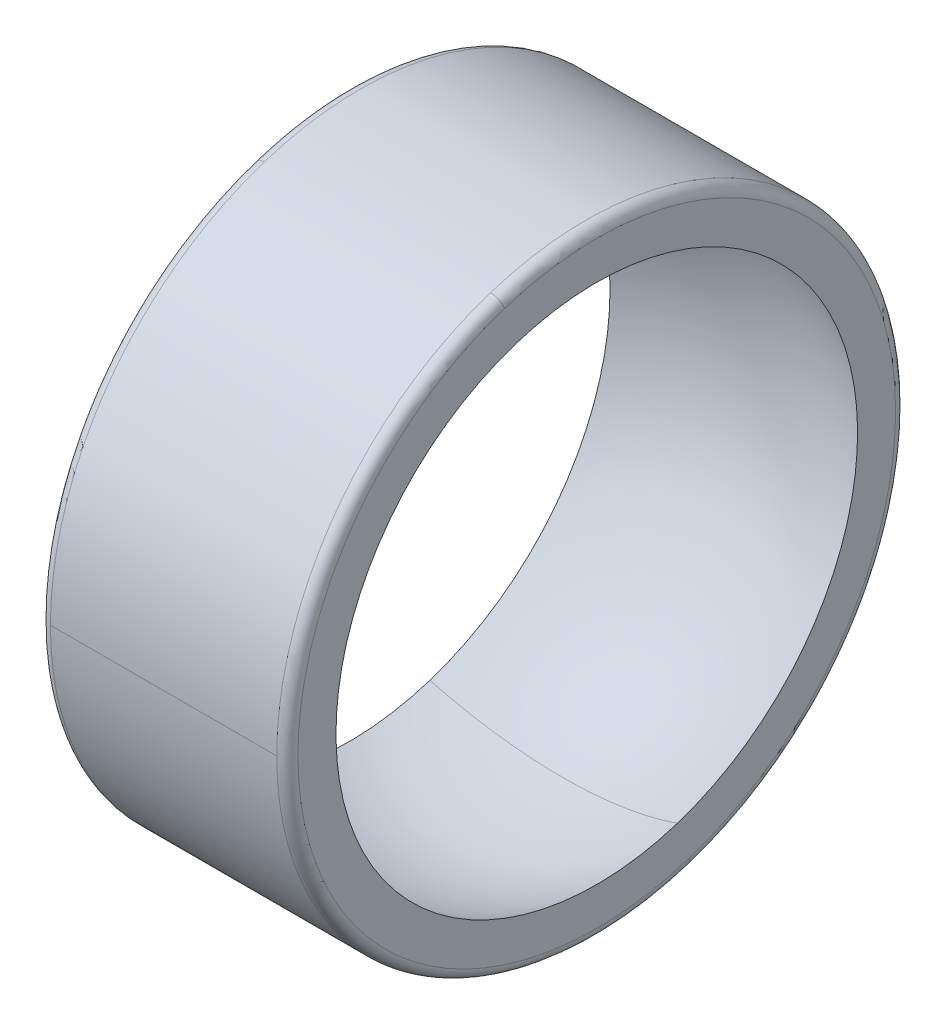
ISO-10303-21;
HEADER;
FILE_DESCRIPTION(('STEP AP214'),'2;1');
FILE_NAME('part.step','',(''),(''),'','','');
FILE_SCHEMA(('AUTOMOTIVE_DESIGN { 1 0 10303 214 1 1 1 1 }'));
ENDSEC;
DATA;
#1=APPLICATION_CONTEXT('core data for automotive mechanical design processes');
#2=APPLICATION_PROTOCOL_DEFINITION('international standard','automotive_design',2000,#1);
#3=PRODUCT_CONTEXT('',#1,'mechanical');
#4=PRODUCT('Part','Part','',(#3));
#5=PRODUCT_RELATED_PRODUCT_CATEGORY('part','',(#4));
#6=PRODUCT_DEFINITION_FORMATION('','',#4);
#7=PRODUCT_DEFINITION_CONTEXT('part definition',#1,'design');
#8=PRODUCT_DEFINITION('design','',#6,#7);
#9=PRODUCT_DEFINITION_SHAPE('','',#8);
#10=(LENGTH_UNIT() NAMED_UNIT(*) SI_UNIT(.MILLI.,.METRE.));
#11=(NAMED_UNIT(*) PLANE_ANGLE_UNIT() SI_UNIT($,.RADIAN.));
#12=(NAMED_UNIT(*) SI_UNIT($,.STERADIAN.) SOLID_ANGLE_UNIT());
#13=UNCERTAINTY_MEASURE_WITH_UNIT(LENGTH_MEASURE(1.E-05),#10,'distance_accuracy_value','');
#14=(GEOMETRIC_REPRESENTATION_CONTEXT(3) GLOBAL_UNCERTAINTY_ASSIGNED_CONTEXT((#13)) GLOBAL_UNIT_ASSIGNED_CONTEXT((#10,
#11,#12)) REPRESENTATION_CONTEXT('',''));
#15=CARTESIAN_POINT('',(0.,0.,0.));
#16=DIRECTION('',(0.,0.,1.));
#17=DIRECTION('',(1.,0.,0.));
#18=AXIS2_PLACEMENT_3D('',#15,#16,#17);
#19=CARTESIAN_POINT('',(0.,16.9,0.));
#20=DIRECTION('',(-1.,0.,0.));
#21=DIRECTION('',(0.,0.,1.));
#22=AXIS2_PLACEMENT_3D('',#19,#20,#21);
#23=PLANE('',#22);
#24=CARTESIAN_POINT('',(0.,0.,0.));
#25=DIRECTION('',(1.,0.,0.));
#26=DIRECTION('',(0.,0.,-1.));
#27=AXIS2_PLACEMENT_3D('',#24,#25,#26);
#28=CIRCLE('',#27,14.75);
#29=CARTESIAN_POINT('',(0.,14.0280836153535,4.55800066703048));
#30=VERTEX_POINT('',#29);
#31=CARTESIAN_POINT('',(0.,-14.0280836153535,-4.55800066703048));
#32=VERTEX_POINT('',#31);
#33=EDGE_CURVE('E11',#30,#32,#28,.T.);
#34=ORIENTED_EDGE('',*,*,#33,.T.);
#35=CARTESIAN_POINT('',(0.,0.,0.));
#36=DIRECTION('',(1.,0.,0.));
#37=DIRECTION('',(0.,-0.951056516295154,-0.309016994374947));
#38=AXIS2_PLACEMENT_3D('',#35,#36,#37);
#39=CIRCLE('',#38,14.75);
#40=EDGE_CURVE('E26',#32,#30,#39,.T.);
#41=ORIENTED_EDGE('',*,*,#40,.T.);
#42=EDGE_LOOP('',(#34,#41));
#43=FACE_BOUND('',#42,.T.);
#44=CARTESIAN_POINT('',(0.,16.0728551253881,5.22238720493665));
#45=CARTESIAN_POINT('',(0.,15.987409506985,5.48538076014823));
#46=CARTESIAN_POINT('',(0.,15.8954983020356,5.74627299413518));
#47=CARTESIAN_POINT('',(0.,15.6989902437607,6.26323546914296));
#48=CARTESIAN_POINT('',(0.,15.5943933904351,6.51930571016379));
#49=CARTESIAN_POINT('',(0.,15.3727595601241,7.02600484872245));
#50=CARTESIAN_POINT('',(0.,15.2557225831386,7.27663374626028));
#51=CARTESIAN_POINT('',(0.,15.0094921883233,7.77184706866862));
#52=CARTESIAN_POINT('',(0.,14.8802987704936,8.01643149353914));
#53=CARTESIAN_POINT('',(0.,14.6100662685669,8.49896646905802));
#54=CARTESIAN_POINT('',(0.,14.4690271844699,8.73691701970638));
#55=CARTESIAN_POINT('',(0.,14.1754432497592,9.20561105028911));
#56=CARTESIAN_POINT('',(0.,14.0228983991455,9.43635453022346));
#57=CARTESIAN_POINT('',(0.,13.7066703920169,9.8900785254699));
#58=CARTESIAN_POINT('',(0.,13.542987235502,10.113059040782));
#59=CARTESIAN_POINT('',(0.,13.2048769525523,10.5507199305825));
#60=CARTESIAN_POINT('',(0.,13.0304498261175,10.7654003050708));
#61=CARTESIAN_POINT('',(0.,12.6712718111635,11.1859437284894));
#62=CARTESIAN_POINT('',(0.,12.4865209226442,11.3918067774196));
#63=CARTESIAN_POINT('',(0.,12.1071404652344,11.7942196078489));
#64=CARTESIAN_POINT('',(0.,11.9125108963438,11.9907693893481));
#65=CARTESIAN_POINT('',(0.,11.5138419576987,12.3740821792106));
#66=CARTESIAN_POINT('',(0.,11.3098025879441,12.5608451875741));
#67=CARTESIAN_POINT('',(0.,10.8928055963306,12.9241345027371));
#68=CARTESIAN_POINT('',(0.,10.6798479744716,13.1006608095368));
#69=CARTESIAN_POINT('',(0.,10.2455275122007,13.4430514542325));
#70=CARTESIAN_POINT('',(0.,10.0241646717889,13.6089157921286));
#71=CARTESIAN_POINT('',(0.,9.57356705488723,13.9295829173006));
#72=CARTESIAN_POINT('',(0.,9.34433227839746,14.0843857045765));
#73=CARTESIAN_POINT('',(0.,8.87854303599429,14.382556795034));
#74=CARTESIAN_POINT('',(0.,8.64198857008088,14.5259250982157));
#75=CARTESIAN_POINT('',(0.,8.16212982925878,14.8008818336849));
#76=CARTESIAN_POINT('',(0.,7.91882555435008,14.9324702659725));
#77=CARTESIAN_POINT('',(0.,7.42605333684654,15.1835502515944));
#78=CARTESIAN_POINT('',(0.,7.17658539425168,15.3030418049287));
#79=CARTESIAN_POINT('',(0.,6.67208683150036,15.5296401670258));
#80=CARTESIAN_POINT('',(0.,6.41705621134388,15.6367469757886));
#81=CARTESIAN_POINT('',(0.,5.90204668457131,15.838317819059));
#82=CARTESIAN_POINT('',(0.,5.64206777795521,15.9327818535666));
#83=CARTESIAN_POINT('',(0.,5.1177879902209,16.1088395761933));
#84=CARTESIAN_POINT('',(0.,4.85348710910268,16.1904332643124));
#85=CARTESIAN_POINT('',(0.,4.32120009633676,16.3405537278209));
#86=CARTESIAN_POINT('',(0.,4.05321396468906,16.4090805032101));
#87=CARTESIAN_POINT('',(0.,3.51420205292812,16.5329020542546));
#88=CARTESIAN_POINT('',(0.,3.24317627281489,16.5881968299099));
#89=CARTESIAN_POINT('',(0.,2.69873798896623,16.6854211715285));
#90=CARTESIAN_POINT('',(0.,2.42532548523081,16.7273507374919));
#91=CARTESIAN_POINT('',(0.,1.87677242880739,16.7977436477299));
#92=CARTESIAN_POINT('',(0.,1.60163187611939,16.8262069920044));
#93=CARTESIAN_POINT('',(0.,1.05028555948171,16.8695988881753));
#94=CARTESIAN_POINT('',(0.,0.774079795532018,16.8845274400716));
#95=CARTESIAN_POINT('',(0.,0.221268460249076,16.9008137872967));
#96=CARTESIAN_POINT('',(0.,-0.0553371110841769,16.9021715826256));
#97=CARTESIAN_POINT('',(0.,-0.608281694085119,16.8913131456681));
#98=CARTESIAN_POINT('',(0.,-0.884620705752808,16.8790969133818));
#99=CARTESIAN_POINT('',(0.,-1.43636644453908,16.8411198511674));
#100=CARTESIAN_POINT('',(0.,-1.71177317165766,16.8153590212393));
#101=CARTESIAN_POINT('',(0.,-2.26099086241731,16.7503548238372));
#102=CARTESIAN_POINT('',(0.,-2.53480182605837,16.7111114563632));
#103=CARTESIAN_POINT('',(0.,-3.08016835526856,16.6192367245786));
#104=CARTESIAN_POINT('',(0.,-3.35172392083769,16.5666053602681));
#105=CARTESIAN_POINT('',(0.,-3.89192545276109,16.4480814283773));
#106=CARTESIAN_POINT('',(0.,-4.16057141911536,16.382188860797));
#107=CARTESIAN_POINT('',(0.,-4.6943065609455,16.2373012633333));
#108=CARTESIAN_POINT('',(0.,-4.95939573642137,16.1583062334499));
#109=CARTESIAN_POINT('',(0.,-5.48537867345191,15.9874040173263));
#110=CARTESIAN_POINT('',(0.,-5.74627243500658,15.895496831086));
#111=CARTESIAN_POINT('',(0.,-6.26323602827154,15.6989917147103));
#112=CARTESIAN_POINT('',(0.,-6.51930585998183,15.5943937845749));
#113=CARTESIAN_POINT('',(0.,-7.02600469890438,15.3727591659843));
#114=CARTESIAN_POINT('',(0.,-7.27663370611664,15.2557224775291));
#115=CARTESIAN_POINT('',(0.,-7.77184710881223,15.0094922939328));
#116=CARTESIAN_POINT('',(0.,-8.01643150429557,14.8802987987916));
#117=CARTESIAN_POINT('',(0.,-8.49896645830155,14.6100662402689));
#118=CARTESIAN_POINT('',(0.,-8.73691701682419,14.4690271768875));
#119=CARTESIAN_POINT('',(0.,-9.20561105317127,14.1754432573416));
#120=CARTESIAN_POINT('',(0.,-9.43635453099572,14.0228984011772));
#121=CARTESIAN_POINT('',(0.,-9.89007852469761,13.7066703899852));
#122=CARTESIAN_POINT('',(0.,-10.113059040575,13.5429872349576));
#123=CARTESIAN_POINT('',(0.,-10.5507199307894,13.2048769530967));
#124=CARTESIAN_POINT('',(0.,-10.7654003051263,13.0304498262634));
#125=CARTESIAN_POINT('',(0.,-11.185943728434,12.6712718110176));
#126=CARTESIAN_POINT('',(0.,-11.3918067774048,12.4865209226051));
#127=CARTESIAN_POINT('',(0.,-11.7942196078638,12.1071404652735));
#128=CARTESIAN_POINT('',(0.,-11.990769389352,11.9125108963543));
#129=CARTESIAN_POINT('',(0.,-12.3740821792066,11.5138419576882));
#130=CARTESIAN_POINT('',(0.,-12.560845187573,11.3098025879413));
#131=CARTESIAN_POINT('',(0.,-12.9241345027382,10.8928055963334));
#132=CARTESIAN_POINT('',(0.,-13.100660809537,10.6798479744724));
#133=CARTESIAN_POINT('',(0.,-13.4430514542322,10.2455275122));
#134=CARTESIAN_POINT('',(0.,-13.6089157921285,10.0241646717887));
#135=CARTESIAN_POINT('',(0.,-13.9295829173007,9.57356705488745));
#136=CARTESIAN_POINT('',(0.,-14.0843857045765,9.34433227839753));
#137=CARTESIAN_POINT('',(0.,-14.382556795034,8.87854303599425));
#138=CARTESIAN_POINT('',(0.,-14.5259250982157,8.64198857008088));
#139=CARTESIAN_POINT('',(0.,-14.8008818336849,8.16212982925881));
#140=CARTESIAN_POINT('',(0.,-14.9324702659725,7.91882555435011));
#141=CARTESIAN_POINT('',(0.,-15.1835502515944,7.42605333684655));
#142=CARTESIAN_POINT('',(0.,-15.3030418049286,7.1765853942517));
#143=CARTESIAN_POINT('',(0.,-15.5296401670258,6.67208683150036));
#144=CARTESIAN_POINT('',(0.,-15.6367469757886,6.41705621134388));
#145=CARTESIAN_POINT('',(0.,-15.8383178190589,5.90204668457134));
#146=CARTESIAN_POINT('',(0.,-15.9327818535664,5.64206777795529));
#147=CARTESIAN_POINT('',(0.,-16.1088395761935,5.11778799022086));
#148=CARTESIAN_POINT('',(0.,-16.1904332643132,4.85348710910249));
#149=CARTESIAN_POINT('',(0.,-16.3405537278201,4.32120009633699));
#150=CARTESIAN_POINT('',(0.,-16.4090805032072,4.05321396468987));
#151=CARTESIAN_POINT('',(0.,-16.5329020542575,3.51420205292736));
#152=CARTESIAN_POINT('',(0.,-16.5881968299207,3.24317627281197));
#153=CARTESIAN_POINT('',(0.,-16.6854211715177,2.69873798896919));
#154=CARTESIAN_POINT('',(0.,-16.7273507374515,2.42532548524178));
#155=CARTESIAN_POINT('',(0.,-16.7977436477702,1.87677242879645));
#156=CARTESIAN_POINT('',(0.,-16.826206992155,1.60163187607852));
#157=CARTESIAN_POINT('',(0.,-16.8695988880247,1.0502855595226));
#158=CARTESIAN_POINT('',(0.,-16.8845274395095,0.774079795684606));
#159=CARTESIAN_POINT('',(0.,-16.9008137878588,0.221268460096517));
#160=CARTESIAN_POINT('',(0.,-16.9021715847233,-0.0553371116535784));
#161=CARTESIAN_POINT('',(0.,-16.8913131435705,-0.608281693515684));
#162=CARTESIAN_POINT('',(0.,-16.8790969055534,-0.884620703627695));
#163=CARTESIAN_POINT('',(0.,-16.8411198589958,-1.43636644666416));
#164=CARTESIAN_POINT('',(0.,-16.8153590504553,-1.71177317958862));
#165=CARTESIAN_POINT('',(0.,-16.7503547946212,-2.26099085448633));
#166=CARTESIAN_POINT('',(0.,-16.7111113473275,-2.53480179645957));
#167=CARTESIAN_POINT('',(0.,-16.6192368336143,-3.08016838486734));
#168=CARTESIAN_POINT('',(0.,-16.5666057671948,-3.35172403130186));
#169=CARTESIAN_POINT('',(0.,-16.4480810214507,-3.89192534229689));
#170=CARTESIAN_POINT('',(0.,-16.3821873421262,-4.16057100685739));
#171=CARTESIAN_POINT('',(0.,-16.2373027820041,-4.69430697320345));
#172=CARTESIAN_POINT('',(0.,-16.1583119012064,-4.959397274989));
#173=CARTESIAN_POINT('',(0.,-16.0728551253881,-5.22238720493662));
#174=B_SPLINE_CURVE_WITH_KNOTS('',3,(#44,#45,#46,#47,#48,#49,#50,#51,#52,#53,#54,#55,#56,#57,
#58,#59,#60,#61,#62,#63,#64,#65,#66,#67,#68,#69,#70,#71,#72,#73,#74,#75,#76,#77,#78,#79,#80,#81,
#82,#83,#84,#85,#86,#87,#88,#89,#90,#91,#92,#93,#94,#95,#96,#97,#98,#99,#100,#101,#102,#103,
#104,#105,#106,#107,#108,#109,#110,#111,#112,#113,#114,#115,#116,#117,#118,#119,#120,#121,#122,
#123,#124,#125,#126,#127,#128,#129,#130,#131,#132,#133,#134,#135,#136,#137,#138,#139,#140,#141,
#142,#143,#144,#145,#146,#147,#148,#149,#150,#151,#152,#153,#154,#155,#156,#157,#158,#159,#160,
#161,#162,#163,#164,#165,#166,#167,#168,#169,#170,#171,#172,#173),.UNSPECIFIED.,.F.,.F.,(4,2,2,
2,2,2,2,2,2,2,2,2,2,2,2,2,2,2,2,2,2,2,2,2,2,2,2,2,2,2,2,2,2,2,2,2,2,2,2,2,2,2,2,2,2,2,2,2,2,2,2,
2,2,2,2,2,2,2,2,2,2,2,2,2,4),(0.,0.829493524074432,1.65898704814887,2.4884805722233,
3.31797409629774,4.14746762037217,4.97696114444661,5.80645466852104,6.63594819259548,
7.46544171666991,8.29493524074435,9.12442876481879,9.95392228889322,10.7834158129677,
11.6129093370421,12.4424028611165,13.271896385191,14.1013899092654,14.9308834333398,
15.7603769574143,16.5898704814887,17.4193640055631,18.2488575296376,19.078351053712,
19.9078445777864,20.7373381018609,21.5668316259353,22.3963251500097,23.2258186740842,
24.0553121981586,24.8848057222331,25.7142992463075,26.5437927703819,27.3732862944564,
28.2027798185308,29.0322733426052,29.8617668666797,30.6912603907541,31.5207539148285,
32.350247438903,33.1797409629774,34.0092344870518,34.8387280111263,35.6682215352007,
36.4977150592751,37.3272085833496,38.156702107424,38.9861956314984,39.8156891555729,
40.6451826796473,41.4746762037217,42.3041697277962,43.1336632518706,43.963156775945,
44.7926503000195,45.6221438240939,46.4516373481684,47.2811308722428,48.1106243963172,
48.9401179203916,49.7696114444661,50.5991049685405,51.4285984926149,52.2580920166894,
53.0875855407638),.UNSPECIFIED.);
#175=CARTESIAN_POINT('',(0.,16.0728551253881,5.22238720493661));
#176=VERTEX_POINT('',#175);
#177=CARTESIAN_POINT('',(0.,-16.0728551253881,-5.22238720493661));
#178=VERTEX_POINT('',#177);
#179=EDGE_CURVE('E154',#176,#178,#174,.T.);
#180=ORIENTED_EDGE('',*,*,#179,.F.);
#181=CARTESIAN_POINT('',(0.,-16.0728551253881,-5.22238720493665));
#182=CARTESIAN_POINT('',(0.,-15.987409506985,-5.48538076014823));
#183=CARTESIAN_POINT('',(0.,-15.8954983020356,-5.74627299413518));
#184=CARTESIAN_POINT('',(0.,-15.6989902437607,-6.26323546914296));
#185=CARTESIAN_POINT('',(0.,-15.5943933904351,-6.51930571016379));
#186=CARTESIAN_POINT('',(0.,-15.3727595601241,-7.02600484872245));
#187=CARTESIAN_POINT('',(0.,-15.2557225831386,-7.27663374626028));
#188=CARTESIAN_POINT('',(0.,-15.0094921883234,-7.77184706866862));
#189=CARTESIAN_POINT('',(0.,-14.8802987704936,-8.01643149353913));
#190=CARTESIAN_POINT('',(0.,-14.6100662685669,-8.49896646905801));
#191=CARTESIAN_POINT('',(0.,-14.4690271844699,-8.73691701970638));
#192=CARTESIAN_POINT('',(0.,-14.1754432497592,-9.2056110502891));
#193=CARTESIAN_POINT('',(0.,-14.0228983991455,-9.43635453022345));
#194=CARTESIAN_POINT('',(0.,-13.7066703920169,-9.8900785254699));
#195=CARTESIAN_POINT('',(0.,-13.542987235502,-10.113059040782));
#196=CARTESIAN_POINT('',(0.,-13.2048769525523,-10.5507199305825));
#197=CARTESIAN_POINT('',(0.,-13.0304498261175,-10.7654003050708));
#198=CARTESIAN_POINT('',(0.,-12.6712718111635,-11.1859437284894));
#199=CARTESIAN_POINT('',(0.,-12.4865209226442,-11.3918067774196));
#200=CARTESIAN_POINT('',(0.,-12.1071404652344,-11.7942196078489));
#201=CARTESIAN_POINT('',(0.,-11.9125108963438,-11.9907693893481));
#202=CARTESIAN_POINT('',(0.,-11.5138419576987,-12.3740821792106));
#203=CARTESIAN_POINT('',(0.,-11.3098025879441,-12.5608451875741));
#204=CARTESIAN_POINT('',(0.,-10.8928055963306,-12.9241345027371));
#205=CARTESIAN_POINT('',(0.,-10.6798479744716,-13.1006608095367));
#206=CARTESIAN_POINT('',(0.,-10.2455275122007,-13.4430514542325));
#207=CARTESIAN_POINT('',(0.,-10.0241646717889,-13.6089157921286));
#208=CARTESIAN_POINT('',(0.,-9.57356705488725,-13.9295829173006));
#209=CARTESIAN_POINT('',(0.,-9.34433227839748,-14.0843857045765));
#210=CARTESIAN_POINT('',(0.,-8.8785430359943,-14.382556795034));
#211=CARTESIAN_POINT('',(0.,-8.64198857008089,-14.5259250982157));
#212=CARTESIAN_POINT('',(0.,-8.16212982925879,-14.8008818336849));
#213=CARTESIAN_POINT('',(0.,-7.9188255543501,-14.9324702659725));
#214=CARTESIAN_POINT('',(0.,-7.42605333684655,-15.1835502515944));
#215=CARTESIAN_POINT('',(0.,-7.1765853942517,-15.3030418049287));
#216=CARTESIAN_POINT('',(0.,-6.67208683150037,-15.5296401670258));
#217=CARTESIAN_POINT('',(0.,-6.4170562113439,-15.6367469757886));
#218=CARTESIAN_POINT('',(0.,-5.90204668457133,-15.838317819059));
#219=CARTESIAN_POINT('',(0.,-5.64206777795523,-15.9327818535666));
#220=CARTESIAN_POINT('',(0.,-5.11778799022092,-16.1088395761933));
#221=CARTESIAN_POINT('',(0.,-4.8534871091027,-16.1904332643124));
#222=CARTESIAN_POINT('',(0.,-4.32120009633678,-16.3405537278208));
#223=CARTESIAN_POINT('',(0.,-4.05321396468908,-16.4090805032101));
#224=CARTESIAN_POINT('',(0.,-3.51420205292814,-16.5329020542546));
#225=CARTESIAN_POINT('',(0.,-3.24317627281491,-16.5881968299098));
#226=CARTESIAN_POINT('',(0.,-2.69873798896626,-16.6854211715285));
#227=CARTESIAN_POINT('',(0.,-2.42532548523084,-16.7273507374919));
#228=CARTESIAN_POINT('',(0.,-1.87677242880742,-16.7977436477299));
#229=CARTESIAN_POINT('',(0.,-1.60163187611942,-16.8262069920044));
#230=CARTESIAN_POINT('',(0.,-1.05028555948173,-16.8695988881753));
#231=CARTESIAN_POINT('',(0.,-0.774079795532037,-16.8845274400716));
#232=CARTESIAN_POINT('',(0.,-0.221268460249095,-16.9008137872967));
#233=CARTESIAN_POINT('',(0.,0.055337111084155,-16.9021715826256));
#234=CARTESIAN_POINT('',(0.,0.608281694085094,-16.8913131456681));
#235=CARTESIAN_POINT('',(0.,0.884620705752784,-16.8790969133818));
#236=CARTESIAN_POINT('',(0.,1.43636644453905,-16.8411198511674));
#237=CARTESIAN_POINT('',(0.,1.71177317165763,-16.8153590212393));
#238=CARTESIAN_POINT('',(0.,2.26099086241728,-16.7503548238372));
#239=CARTESIAN_POINT('',(0.,2.53480182605834,-16.7111114563632));
#240=CARTESIAN_POINT('',(0.,3.08016835526853,-16.6192367245786));
#241=CARTESIAN_POINT('',(0.,3.35172392083766,-16.5666053602681));
#242=CARTESIAN_POINT('',(0.,3.89192545276106,-16.4480814283773));
#243=CARTESIAN_POINT('',(0.,4.16057141911533,-16.382188860797));
#244=CARTESIAN_POINT('',(0.,4.69430656094547,-16.2373012633333));
#245=CARTESIAN_POINT('',(0.,4.95939573642134,-16.1583062334499));
#246=CARTESIAN_POINT('',(0.,5.48537867345187,-15.9874040173263));
#247=CARTESIAN_POINT('',(0.,5.74627243500654,-15.895496831086));
#248=CARTESIAN_POINT('',(0.,6.26323602827151,-15.6989917147103));
#249=CARTESIAN_POINT('',(0.,6.5193058599818,-15.5943937845749));
#250=CARTESIAN_POINT('',(0.,7.02600469890435,-15.3727591659843));
#251=CARTESIAN_POINT('',(0.,7.27663370611661,-15.2557224775292));
#252=CARTESIAN_POINT('',(0.,7.77184710881221,-15.0094922939328));
#253=CARTESIAN_POINT('',(0.,8.01643150429554,-14.8802987987916));
#254=CARTESIAN_POINT('',(0.,8.49896645830152,-14.610066240269));
#255=CARTESIAN_POINT('',(0.,8.73691701682415,-14.4690271768875));
#256=CARTESIAN_POINT('',(0.,9.20561105317124,-14.1754432573416));
#257=CARTESIAN_POINT('',(0.,9.43635453099569,-14.0228984011772));
#258=CARTESIAN_POINT('',(0.,9.89007852469758,-13.7066703899852));
#259=CARTESIAN_POINT('',(0.,10.113059040575,-13.5429872349576));
#260=CARTESIAN_POINT('',(0.,10.5507199307894,-13.2048769530967));
#261=CARTESIAN_POINT('',(0.,10.7654003051262,-13.0304498262634));
#262=CARTESIAN_POINT('',(0.,11.1859437284339,-12.6712718110176));
#263=CARTESIAN_POINT('',(0.,11.3918067774047,-12.4865209226052));
#264=CARTESIAN_POINT('',(0.,11.7942196078638,-12.1071404652735));
#265=CARTESIAN_POINT('',(0.,11.990769389352,-11.9125108963543));
#266=CARTESIAN_POINT('',(0.,12.3740821792066,-11.5138419576882));
#267=CARTESIAN_POINT('',(0.,12.560845187573,-11.3098025879414));
#268=CARTESIAN_POINT('',(0.,12.9241345027382,-10.8928055963335));
#269=CARTESIAN_POINT('',(0.,13.100660809537,-10.6798479744724));
#270=CARTESIAN_POINT('',(0.,13.4430514542322,-10.2455275122));
#271=CARTESIAN_POINT('',(0.,13.6089157921285,-10.0241646717887));
#272=CARTESIAN_POINT('',(0.,13.9295829173006,-9.57356705488749));
#273=CARTESIAN_POINT('',(0.,14.0843857045765,-9.34433227839757));
#274=CARTESIAN_POINT('',(0.,14.382556795034,-8.87854303599429));
#275=CARTESIAN_POINT('',(0.,14.5259250982157,-8.64198857008092));
#276=CARTESIAN_POINT('',(0.,14.8008818336849,-8.16212982925885));
#277=CARTESIAN_POINT('',(0.,14.9324702659725,-7.91882555435015));
#278=CARTESIAN_POINT('',(0.,15.1835502515943,-7.42605333684659));
#279=CARTESIAN_POINT('',(0.,15.3030418049286,-7.17658539425174));
#280=CARTESIAN_POINT('',(0.,15.5296401670258,-6.67208683150041));
#281=CARTESIAN_POINT('',(0.,15.6367469757886,-6.41705621134392));
#282=CARTESIAN_POINT('',(0.,15.8383178190589,-5.90204668457138));
#283=CARTESIAN_POINT('',(0.,15.9327818535663,-5.64206777795533));
#284=CARTESIAN_POINT('',(0.,16.1088395761935,-5.11778799022091));
#285=CARTESIAN_POINT('',(0.,16.1904332643132,-4.85348710910253));
#286=CARTESIAN_POINT('',(0.,16.3405537278201,-4.32120009633704));
#287=CARTESIAN_POINT('',(0.,16.4090805032072,-4.05321396468991));
#288=CARTESIAN_POINT('',(0.,16.5329020542575,-3.5142020529274));
#289=CARTESIAN_POINT('',(0.,16.5881968299207,-3.24317627281202));
#290=CARTESIAN_POINT('',(0.,16.6854211715177,-2.69873798896924));
#291=CARTESIAN_POINT('',(0.,16.7273507374515,-2.42532548524184));
#292=CARTESIAN_POINT('',(0.,16.7977436477702,-1.87677242879651));
#293=CARTESIAN_POINT('',(0.,16.826206992155,-1.60163187607858));
#294=CARTESIAN_POINT('',(0.,16.8695988880247,-1.05028555952266));
#295=CARTESIAN_POINT('',(0.,16.8845274395095,-0.774079795684668));
#296=CARTESIAN_POINT('',(0.,16.9008137878588,-0.221268460096578));
#297=CARTESIAN_POINT('',(0.,16.9021715847233,0.0553371116535163));
#298=CARTESIAN_POINT('',(0.,16.8913131435705,0.608281693515621));
#299=CARTESIAN_POINT('',(0.,16.8790969055534,0.884620703627632));
#300=CARTESIAN_POINT('',(0.,16.8411198589958,1.4363664466641));
#301=CARTESIAN_POINT('',(0.,16.8153590504553,1.71177317958856));
#302=CARTESIAN_POINT('',(0.,16.7503547946212,2.26099085448627));
#303=CARTESIAN_POINT('',(0.,16.7111113473275,2.53480179645951));
#304=CARTESIAN_POINT('',(0.,16.6192368336143,3.08016838486728));
#305=CARTESIAN_POINT('',(0.,16.5666057671948,3.3517240313018));
#306=CARTESIAN_POINT('',(0.,16.4480810214507,3.89192534229683));
#307=CARTESIAN_POINT('',(0.,16.3821873421262,4.16057100685733));
#308=CARTESIAN_POINT('',(0.,16.2373027820041,4.69430697320339));
#309=CARTESIAN_POINT('',(0.,16.1583119012064,4.95939727498894));
#310=CARTESIAN_POINT('',(0.,16.0728551253881,5.22238720493656));
#311=B_SPLINE_CURVE_WITH_KNOTS('',3,(#181,#182,#183,#184,#185,#186,#187,#188,#189,#190,#191,
#192,#193,#194,#195,#196,#197,#198,#199,#200,#201,#202,#203,#204,#205,#206,#207,#208,#209,#210,
#211,#212,#213,#214,#215,#216,#217,#218,#219,#220,#221,#222,#223,#224,#225,#226,#227,#228,#229,
#230,#231,#232,#233,#234,#235,#236,#237,#238,#239,#240,#241,#242,#243,#244,#245,#246,#247,#248,
#249,#250,#251,#252,#253,#254,#255,#256,#257,#258,#259,#260,#261,#262,#263,#264,#265,#266,#267,
#268,#269,#270,#271,#272,#273,#274,#275,#276,#277,#278,#279,#280,#281,#282,#283,#284,#285,#286,
#287,#288,#289,#290,#291,#292,#293,#294,#295,#296,#297,#298,#299,#300,#301,#302,#303,#304,#305,
#306,#307,#308,#309,#310),.UNSPECIFIED.,.F.,.F.,(4,2,2,2,2,2,2,2,2,2,2,2,2,2,2,2,2,2,2,2,2,2,2,
2,2,2,2,2,2,2,2,2,2,2,2,2,2,2,2,2,2,2,2,2,2,2,2,2,2,2,2,2,2,2,2,2,2,2,2,2,2,2,2,2,4),(0.,
0.829493524074432,1.65898704814887,2.4884805722233,3.31797409629774,4.14746762037217,
4.9769611444466,5.80645466852103,6.63594819259547,7.46544171666991,8.29493524074434,
9.12442876481877,9.9539222888932,10.7834158129676,11.6129093370421,12.4424028611165,
13.2718963851909,14.1013899092654,14.9308834333398,15.7603769574142,16.5898704814887,
17.4193640055631,18.2488575296375,19.078351053712,19.9078445777864,20.7373381018609,
21.5668316259353,22.3963251500097,23.2258186740841,24.0553121981586,24.884805722233,
25.7142992463075,26.5437927703819,27.3732862944563,28.2027798185308,29.0322733426052,
29.8617668666796,30.6912603907541,31.5207539148285,32.3502474389029,33.1797409629774,
34.0092344870518,34.8387280111262,35.6682215352007,36.4977150592751,37.3272085833495,
38.156702107424,38.9861956314984,39.8156891555728,40.6451826796473,41.4746762037217,
42.3041697277961,43.1336632518706,43.963156775945,44.7926503000194,45.6221438240939,
46.4516373481683,47.2811308722427,48.1106243963171,48.9401179203916,49.769611444466,
50.5991049685405,51.4285984926149,52.2580920166893,53.0875855407638),.UNSPECIFIED.);
#312=EDGE_CURVE('E256',#178,#176,#311,.T.);
#313=ORIENTED_EDGE('',*,*,#312,.F.);
#314=EDGE_LOOP('',(#180,#313));
#315=FACE_BOUND('',#314,.T.);
#316=ADVANCED_FACE('F17',(#43,#315),#23,.T.);
#317=CARTESIAN_POINT('',(0.599999999999879,0.,0.));
#318=DIRECTION('',(1.,0.,0.));
#319=DIRECTION('',(0.,-0.309016994374947,0.951056516295154));
#320=AXIS2_PLACEMENT_3D('',#317,#318,#319);
#321=TOROIDAL_SURFACE('',#320,16.9,0.599999999999878);
#322=CARTESIAN_POINT('',(0.599999999999879,-16.0728551253881,-5.22238720493661));
#323=DIRECTION('',(0.,0.309016994374947,-0.951056516295154));
#324=DIRECTION('',(2.00950367457194E-13,-0.951056516295154,-0.309016994374947));
#325=AXIS2_PLACEMENT_3D('',#322,#323,#324);
#326=CIRCLE('',#325,0.599999999999878);
#327=CARTESIAN_POINT('',(0.6,-16.6434890351651,-5.40779740156154));
#328=VERTEX_POINT('',#327);
#329=EDGE_CURVE('E219',#328,#178,#326,.T.);
#330=ORIENTED_EDGE('',*,*,#329,.T.);
#331=ORIENTED_EDGE('',*,*,#312,.T.);
#332=CARTESIAN_POINT('',(0.599999999999879,16.0728551253881,5.22238720493661));
#333=DIRECTION('',(0.,-0.309016994374947,0.951056516295154));
#334=DIRECTION('',(2.02800739164903E-13,0.951056516295154,0.309016994374947));
#335=AXIS2_PLACEMENT_3D('',#332,#333,#334);
#336=CIRCLE('',#335,0.599999999999878);
#337=CARTESIAN_POINT('',(0.600000000000001,16.6434890351651,5.40779740156154));
#338=VERTEX_POINT('',#337);
#339=EDGE_CURVE('E215',#338,#176,#336,.T.);
#340=ORIENTED_EDGE('',*,*,#339,.F.);
#341=CARTESIAN_POINT('',(0.6,0.,0.));
#342=DIRECTION('',(1.,0.,0.));
#343=DIRECTION('',(0.,0.,-1.));
#344=AXIS2_PLACEMENT_3D('',#341,#342,#343);
#345=CIRCLE('',#344,17.5);
#346=CARTESIAN_POINT('',(0.6,0.,-17.5));
#347=VERTEX_POINT('',#346);
#348=EDGE_CURVE('E210',#347,#338,#345,.T.);
#349=ORIENTED_EDGE('',*,*,#348,.F.);
#350=CARTESIAN_POINT('',(0.6,0.,0.));
#351=DIRECTION('',(1.,0.,0.));
#352=DIRECTION('',(0.,0.,-1.));
#353=AXIS2_PLACEMENT_3D('',#350,#351,#352);
#354=CIRCLE('',#353,17.5);
#355=EDGE_CURVE('E205',#328,#347,#354,.T.);
#356=ORIENTED_EDGE('',*,*,#355,.F.);
#357=EDGE_LOOP('',(#330,#331,#340,#349,#356));
#358=FACE_BOUND('',#357,.T.);
#359=ADVANCED_FACE('F227',(#358),#321,.T.);
#360=CARTESIAN_POINT('',(50.,0.,0.));
#361=DIRECTION('',(1.,0.,0.));
#362=DIRECTION('',(0.,1.,0.));
#363=AXIS2_PLACEMENT_3D('',#360,#361,#362);
#364=CYLINDRICAL_SURFACE('',#363,17.5);
#365=DIRECTION('',(1.,0.,0.));
#366=VECTOR('',#365,1.);
#367=CARTESIAN_POINT('',(0.600000000000001,0.,17.5));
#368=LINE('',#367,#366);
#369=CARTESIAN_POINT('',(0.600000000000001,0.,17.5));
#370=VERTEX_POINT('',#369);
#371=CARTESIAN_POINT('',(13.4,0.,17.5));
#372=VERTEX_POINT('',#371);
#373=EDGE_CURVE('E200',#370,#372,#368,.T.);
#374=ORIENTED_EDGE('',*,*,#373,.F.);
#375=CARTESIAN_POINT('',(0.6,0.,0.));
#376=DIRECTION('',(1.,0.,0.));
#377=DIRECTION('',(0.,0.,-1.));
#378=AXIS2_PLACEMENT_3D('',#375,#376,#377);
#379=CIRCLE('',#378,17.5);
#380=EDGE_CURVE('E195',#370,#328,#379,.T.);
#381=ORIENTED_EDGE('',*,*,#380,.T.);
#382=ORIENTED_EDGE('',*,*,#355,.T.);
#383=DIRECTION('',(1.,0.,0.));
#384=VECTOR('',#383,1.);
#385=CARTESIAN_POINT('',(0.600000000000001,0.,-17.5));
#386=LINE('',#385,#384);
#387=CARTESIAN_POINT('',(13.4,0.,-17.5));
#388=VERTEX_POINT('',#387);
#389=EDGE_CURVE('E191',#347,#388,#386,.T.);
#390=ORIENTED_EDGE('',*,*,#389,.T.);
#391=CARTESIAN_POINT('',(13.4,0.,0.));
#392=DIRECTION('',(1.,0.,0.));
#393=DIRECTION('',(0.,0.,-1.));
#394=AXIS2_PLACEMENT_3D('',#391,#392,#393);
#395=CIRCLE('',#394,17.5);
#396=CARTESIAN_POINT('',(13.4,-16.6434890351652,-5.40779740156158));
#397=VERTEX_POINT('',#396);
#398=EDGE_CURVE('E186',#397,#388,#395,.T.);
#399=ORIENTED_EDGE('',*,*,#398,.F.);
#400=CARTESIAN_POINT('',(13.4,0.,0.));
#401=DIRECTION('',(1.,0.,0.));
#402=DIRECTION('',(0.,0.,-1.));
#403=AXIS2_PLACEMENT_3D('',#400,#401,#402);
#404=CIRCLE('',#403,17.5);
#405=EDGE_CURVE('E181',#372,#397,#404,.T.);
#406=ORIENTED_EDGE('',*,*,#405,.F.);
#407=EDGE_LOOP('',(#374,#381,#382,#390,#399,#406));
#408=FACE_BOUND('',#407,.T.);
#409=ADVANCED_FACE('F236',(#408),#364,.T.);
#410=CARTESIAN_POINT('',(13.4000000000002,0.,0.));
#411=DIRECTION('',(1.,0.,0.));
#412=DIRECTION('',(0.,0.309016994374947,-0.951056516295154));
#413=AXIS2_PLACEMENT_3D('',#410,#411,#412);
#414=TOROIDAL_SURFACE('',#413,16.9000000000003,0.599999999999759);
#415=CARTESIAN_POINT('',(13.4000000000002,-16.0728551253883,-5.22238720493669));
#416=DIRECTION('',(0.,0.309016994374947,-0.951056516295154));
#417=DIRECTION('',(1.,0.,0.));
#418=AXIS2_PLACEMENT_3D('',#415,#416,#417);
#419=CIRCLE('',#418,0.59999999999976);
#420=CARTESIAN_POINT('',(14.,-16.0728551253883,-5.22238720493669));
#421=VERTEX_POINT('',#420);
#422=EDGE_CURVE('E177',#421,#397,#419,.T.);
#423=ORIENTED_EDGE('',*,*,#422,.F.);
#424=CARTESIAN_POINT('',(14.,0.,0.));
#425=DIRECTION('',(1.,0.,0.));
#426=DIRECTION('',(0.,0.,-1.));
#427=AXIS2_PLACEMENT_3D('',#424,#425,#426);
#428=CIRCLE('',#427,16.9);
#429=CARTESIAN_POINT('',(14.,16.0728551253883,5.22238720493669));
#430=VERTEX_POINT('',#429);
#431=EDGE_CURVE('E172',#430,#421,#428,.T.);
#432=ORIENTED_EDGE('',*,*,#431,.F.);
#433=CARTESIAN_POINT('',(13.4000000000002,16.0728551253883,5.22238720493669));
#434=DIRECTION('',(0.,-0.309016994374947,0.951056516295154));
#435=DIRECTION('',(1.,0.,0.));
#436=AXIS2_PLACEMENT_3D('',#433,#434,#435);
#437=CIRCLE('',#436,0.59999999999976);
#438=CARTESIAN_POINT('',(13.4,16.6434890351652,5.40779740156158));
#439=VERTEX_POINT('',#438);
#440=EDGE_CURVE('E168',#430,#439,#437,.T.);
#441=ORIENTED_EDGE('',*,*,#440,.T.);
#442=CARTESIAN_POINT('',(13.4,0.,0.));
#443=DIRECTION('',(1.,0.,0.));
#444=DIRECTION('',(0.,0.,-1.));
#445=AXIS2_PLACEMENT_3D('',#442,#443,#444);
#446=CIRCLE('',#445,17.5);
#447=EDGE_CURVE('E163',#439,#372,#446,.T.);
#448=ORIENTED_EDGE('',*,*,#447,.T.);
#449=ORIENTED_EDGE('',*,*,#405,.T.);
#450=EDGE_LOOP('',(#423,#432,#441,#448,#449));
#451=FACE_BOUND('',#450,.T.);
#452=ADVANCED_FACE('F240',(#451),#414,.T.);
#453=CARTESIAN_POINT('',(50.,0.,0.));
#454=DIRECTION('',(1.,0.,0.));
#455=DIRECTION('',(0.,-1.,0.));
#456=AXIS2_PLACEMENT_3D('',#453,#454,#455);
#457=CYLINDRICAL_SURFACE('',#456,17.5);
#458=ORIENTED_EDGE('',*,*,#373,.T.);
#459=ORIENTED_EDGE('',*,*,#447,.F.);
#460=CARTESIAN_POINT('',(13.4,0.,0.));
#461=DIRECTION('',(1.,0.,0.));
#462=DIRECTION('',(0.,0.,-1.));
#463=AXIS2_PLACEMENT_3D('',#460,#461,#462);
#464=CIRCLE('',#463,17.5);
#465=EDGE_CURVE('E158',#388,#439,#464,.T.);
#466=ORIENTED_EDGE('',*,*,#465,.F.);
#467=ORIENTED_EDGE('',*,*,#389,.F.);
#468=ORIENTED_EDGE('',*,*,#348,.T.);
#469=CARTESIAN_POINT('',(0.6,0.,0.));
#470=DIRECTION('',(1.,0.,0.));
#471=DIRECTION('',(0.,0.,-1.));
#472=AXIS2_PLACEMENT_3D('',#469,#470,#471);
#473=CIRCLE('',#472,17.5);
#474=EDGE_CURVE('E155',#338,#370,#473,.T.);
#475=ORIENTED_EDGE('',*,*,#474,.T.);
#476=EDGE_LOOP('',(#458,#459,#466,#467,#468,#475));
#477=FACE_BOUND('',#476,.T.);
#478=ADVANCED_FACE('F243',(#477),#457,.T.);
#479=CARTESIAN_POINT('',(0.599999999999879,0.,0.));
#480=DIRECTION('',(1.,0.,0.));
#481=DIRECTION('',(0.,0.309016994374947,-0.951056516295154));
#482=AXIS2_PLACEMENT_3D('',#479,#480,#481);
#483=TOROIDAL_SURFACE('',#482,16.9,0.599999999999878);
#484=ORIENTED_EDGE('',*,*,#329,.F.);
#485=ORIENTED_EDGE('',*,*,#380,.F.);
#486=ORIENTED_EDGE('',*,*,#474,.F.);
#487=ORIENTED_EDGE('',*,*,#339,.T.);
#488=ORIENTED_EDGE('',*,*,#179,.T.);
#489=EDGE_LOOP('',(#484,#485,#486,#487,#488));
#490=FACE_BOUND('',#489,.T.);
#491=ADVANCED_FACE('F125',(#490),#483,.T.);
#492=CARTESIAN_POINT('',(13.4000000000002,0.,0.));
#493=DIRECTION('',(1.,0.,0.));
#494=DIRECTION('',(0.,-0.309016994374947,0.951056516295154));
#495=AXIS2_PLACEMENT_3D('',#492,#493,#494);
#496=TOROIDAL_SURFACE('',#495,16.9000000000003,0.599999999999759);
#497=ORIENTED_EDGE('',*,*,#422,.T.);
#498=ORIENTED_EDGE('',*,*,#398,.T.);
#499=ORIENTED_EDGE('',*,*,#465,.T.);
#500=ORIENTED_EDGE('',*,*,#440,.F.);
#501=CARTESIAN_POINT('',(14.,-16.0728551253881,-5.22238720493661));
#502=CARTESIAN_POINT('',(14.,-15.2524911428582,-7.74708176107204));
#503=CARTESIAN_POINT('',(14.,-13.9366087191713,-10.1108513362556));
#504=CARTESIAN_POINT('',(14.,-12.1664772838951,-12.183297265437));
#505=CARTESIAN_POINT('',(14.,-7.90903023716351,-15.5223399097157));
#506=CARTESIAN_POINT('',(14.,-2.70522002417123,-17.0040639502654));
#507=CARTESIAN_POINT('',(14.,0.0118941725665896,-17.2179101085743));
#508=CARTESIAN_POINT('',(14.,5.38342179890137,-16.5684686441492));
#509=CARTESIAN_POINT('',(14.,10.1108110493771,-13.9365731046797));
#510=CARTESIAN_POINT('',(14.,12.183306992082,-12.166488274789));
#511=CARTESIAN_POINT('',(14.,15.5223423508923,-7.90902544608451));
#512=CARTESIAN_POINT('',(14.,17.004049341267,-2.7052186154354));
#513=CARTESIAN_POINT('',(14.,17.2179626013364,0.0118825134701144));
#514=CARTESIAN_POINT('',(14.,16.8931449485878,2.69766855297412));
#515=CARTESIAN_POINT('',(14.,16.0728551253881,5.22238720493661));
#516=B_SPLINE_CURVE_WITH_KNOTS('',5,(#501,#502,#503,#504,#505,#506,#507,#508,#509,#510,#511,
#512,#513,#514,#515),.UNSPECIFIED.,.F.,.F.,(6,3,3,3,6),(0.,0.785398163397448,1.5707963267949,
2.35619449019234,3.14159265358979),.UNSPECIFIED.);
#517=EDGE_CURVE('E90',#421,#430,#516,.T.);
#518=ORIENTED_EDGE('',*,*,#517,.F.);
#519=EDGE_LOOP('',(#497,#498,#499,#500,#518));
#520=FACE_BOUND('',#519,.T.);
#521=ADVANCED_FACE('F119',(#520),#496,.T.);
#522=CARTESIAN_POINT('',(14.,14.75,0.));
#523=DIRECTION('',(1.,0.,0.));
#524=DIRECTION('',(0.,0.,-1.));
#525=AXIS2_PLACEMENT_3D('',#522,#523,#524);
#526=PLANE('',#525);
#527=ORIENTED_EDGE('',*,*,#431,.T.);
#528=ORIENTED_EDGE('',*,*,#517,.T.);
#529=EDGE_LOOP('',(#527,#528));
#530=FACE_BOUND('',#529,.T.);
#531=CARTESIAN_POINT('',(14.,0.,0.));
#532=DIRECTION('',(1.,0.,0.));
#533=DIRECTION('',(0.,-0.951056516295154,-0.309016994374947));
#534=AXIS2_PLACEMENT_3D('',#531,#532,#533);
#535=CIRCLE('',#534,14.75);
#536=CARTESIAN_POINT('',(14.,-14.0280836153535,-4.55800066703048));
#537=VERTEX_POINT('',#536);
#538=CARTESIAN_POINT('',(14.,14.0280836153535,4.55800066703048));
#539=VERTEX_POINT('',#538);
#540=EDGE_CURVE('E81',#537,#539,#535,.T.);
#541=ORIENTED_EDGE('',*,*,#540,.F.);
#542=CARTESIAN_POINT('',(14.,0.,0.));
#543=DIRECTION('',(1.,0.,0.));
#544=DIRECTION('',(0.,0.,-1.));
#545=AXIS2_PLACEMENT_3D('',#542,#543,#544);
#546=CIRCLE('',#545,14.75);
#547=EDGE_CURVE('E78',#539,#537,#546,.T.);
#548=ORIENTED_EDGE('',*,*,#547,.F.);
#549=EDGE_LOOP('',(#541,#548));
#550=FACE_BOUND('',#549,.T.);
#551=ADVANCED_FACE('F80',(#530,#550),#526,.T.);
#552=CARTESIAN_POINT('',(7.,0.,0.));
#553=DIRECTION('',(1.,0.,0.));
#554=DIRECTION('',(0.,0.309016994374947,-0.951056516295154));
#555=AXIS2_PLACEMENT_3D('',#552,#553,#554);
#556=DEGENERATE_TOROIDAL_SURFACE('',#555,0.187499999994775,16.4963300842898,.F.);
#557=CARTESIAN_POINT('',(7.,0.178323096800372,0.057940686443688));
#558=DIRECTION('',(0.,0.309016994374947,-0.951056516295154));
#559=DIRECTION('',(0.424336804867066,-0.861185890411063,-0.279816257912427));
#560=AXIS2_PLACEMENT_3D('',#557,#558,#559);
#561=CIRCLE('',#560,16.4963300842898);
#562=EDGE_CURVE('E85',#537,#32,#561,.T.);
#563=ORIENTED_EDGE('',*,*,#562,.T.);
#564=ORIENTED_EDGE('',*,*,#33,.F.);
#565=CARTESIAN_POINT('',(7.,-0.178323096800372,-0.057940686443688));
#566=DIRECTION('',(0.,-0.309016994374947,0.951056516295154));
#567=DIRECTION('',(0.424336804867067,0.861185890411063,0.279816257912427));
#568=AXIS2_PLACEMENT_3D('',#565,#566,#567);
#569=CIRCLE('',#568,16.4963300842898);
#570=EDGE_CURVE('E89',#539,#30,#569,.T.);
#571=ORIENTED_EDGE('',*,*,#570,.F.);
#572=ORIENTED_EDGE('',*,*,#547,.T.);
#573=EDGE_LOOP('',(#563,#564,#571,#572));
#574=FACE_BOUND('',#573,.T.);
#575=ADVANCED_FACE('F92',(#574),#556,.T.);
#576=CARTESIAN_POINT('',(7.,0.,0.));
#577=DIRECTION('',(1.,0.,0.));
#578=DIRECTION('',(0.,-0.309016994374947,0.951056516295154));
#579=AXIS2_PLACEMENT_3D('',#576,#577,#578);
#580=DEGENERATE_TOROIDAL_SURFACE('',#579,0.187499999994775,16.4963300842898,.F.);
#581=ORIENTED_EDGE('',*,*,#562,.F.);
#582=ORIENTED_EDGE('',*,*,#540,.T.);
#583=ORIENTED_EDGE('',*,*,#570,.T.);
#584=ORIENTED_EDGE('',*,*,#40,.F.);
#585=EDGE_LOOP('',(#581,#582,#583,#584));
#586=FACE_BOUND('',#585,.T.);
#587=ADVANCED_FACE('F88',(#586),#580,.T.);
#588=CLOSED_SHELL('',(#316,#359,#409,#452,#478,#491,#521,#551,#575,#587));
#589=MANIFOLD_SOLID_BREP('B1',#588);
#590=ADVANCED_BREP_SHAPE_REPRESENTATION('',(#18,#589),#14);
#591=SHAPE_DEFINITION_REPRESENTATION(#9,#590);
ENDSEC;
END-ISO-10303-21;
